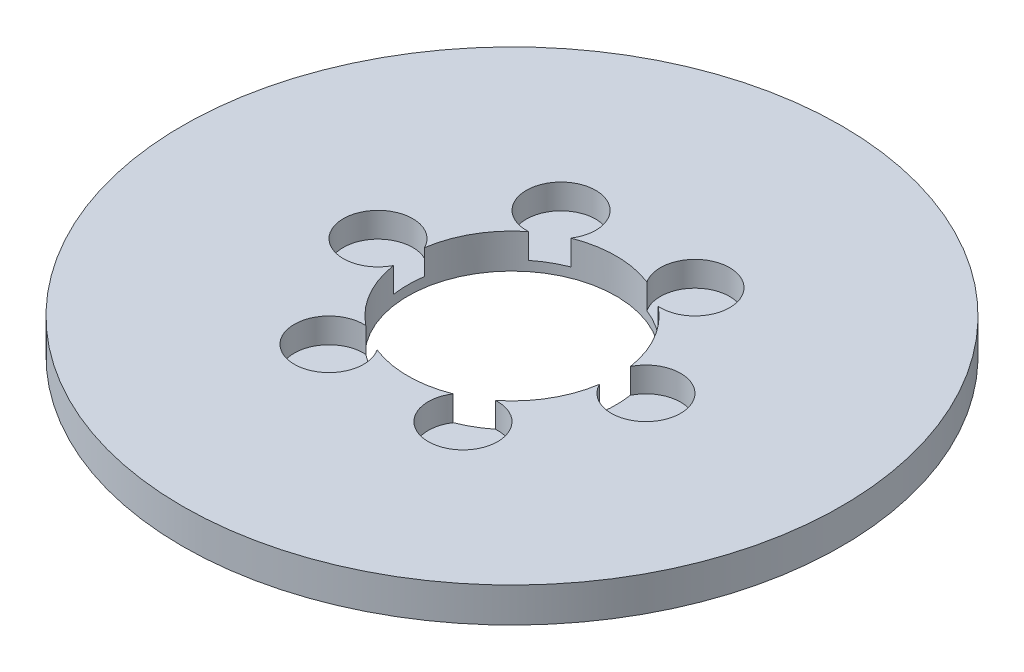
ISO-10303-21;
HEADER;
FILE_DESCRIPTION(('STEP AP214'),'2;1');
FILE_NAME('part.step','',(''),(''),'','','');
FILE_SCHEMA(('AUTOMOTIVE_DESIGN { 1 0 10303 214 1 1 1 1 }'));
ENDSEC;
DATA;
#1=APPLICATION_CONTEXT('core data for automotive mechanical design processes');
#2=APPLICATION_PROTOCOL_DEFINITION('international standard','automotive_design',2000,#1);
#3=PRODUCT_CONTEXT('',#1,'mechanical');
#4=PRODUCT('Part','Part','',(#3));
#5=PRODUCT_RELATED_PRODUCT_CATEGORY('part','',(#4));
#6=PRODUCT_DEFINITION_FORMATION('','',#4);
#7=PRODUCT_DEFINITION_CONTEXT('part definition',#1,'design');
#8=PRODUCT_DEFINITION('design','',#6,#7);
#9=PRODUCT_DEFINITION_SHAPE('','',#8);
#10=(LENGTH_UNIT() NAMED_UNIT(*) SI_UNIT(.MILLI.,.METRE.));
#11=(NAMED_UNIT(*) PLANE_ANGLE_UNIT() SI_UNIT($,.RADIAN.));
#12=(NAMED_UNIT(*) SI_UNIT($,.STERADIAN.) SOLID_ANGLE_UNIT());
#13=UNCERTAINTY_MEASURE_WITH_UNIT(LENGTH_MEASURE(1.E-05),#10,'distance_accuracy_value','');
#14=(GEOMETRIC_REPRESENTATION_CONTEXT(3) GLOBAL_UNCERTAINTY_ASSIGNED_CONTEXT((#13)) GLOBAL_UNIT_ASSIGNED_CONTEXT((#10,
#11,#12)) REPRESENTATION_CONTEXT('',''));
#15=CARTESIAN_POINT('',(0.,0.,0.));
#16=DIRECTION('',(0.,0.,1.));
#17=DIRECTION('',(1.,0.,0.));
#18=AXIS2_PLACEMENT_3D('',#15,#16,#17);
#19=CARTESIAN_POINT('',(0.,10.,0.));
#20=DIRECTION('',(0.,-1.,0.));
#21=DIRECTION('',(0.,0.,-1.));
#22=AXIS2_PLACEMENT_3D('',#19,#20,#21);
#23=CYLINDRICAL_SURFACE('',#22,95.);
#24=CARTESIAN_POINT('',(0.,10.,0.));
#25=DIRECTION('',(0.,1.,0.));
#26=DIRECTION('',(0.,0.,1.));
#27=AXIS2_PLACEMENT_3D('',#24,#25,#26);
#28=CIRCLE('',#27,95.);
#29=CARTESIAN_POINT('',(0.,10.,95.));
#30=VERTEX_POINT('',#29);
#31=EDGE_CURVE('E171',#30,#30,#28,.T.);
#32=ORIENTED_EDGE('',*,*,#31,.F.);
#33=EDGE_LOOP('',(#32));
#34=FACE_BOUND('',#33,.T.);
#35=CARTESIAN_POINT('',(0.,0.,0.));
#36=DIRECTION('',(0.,1.,0.));
#37=DIRECTION('',(0.,0.,1.));
#38=AXIS2_PLACEMENT_3D('',#35,#36,#37);
#39=CIRCLE('',#38,95.);
#40=CARTESIAN_POINT('',(0.,0.,95.));
#41=VERTEX_POINT('',#40);
#42=EDGE_CURVE('E157',#41,#41,#39,.T.);
#43=ORIENTED_EDGE('',*,*,#42,.T.);
#44=EDGE_LOOP('',(#43));
#45=FACE_BOUND('',#44,.T.);
#46=ADVANCED_FACE('F39',(#34,#45),#23,.T.);
#47=CARTESIAN_POINT('',(0.,10.,0.));
#48=DIRECTION('',(0.,1.,0.));
#49=DIRECTION('',(0.,0.,1.));
#50=AXIS2_PLACEMENT_3D('',#47,#48,#49);
#51=PLANE('',#50);
#52=CARTESIAN_POINT('',(-19.3085140114945,10.,-33.4433272865631));
#53=DIRECTION('',(0.,1.,0.));
#54=DIRECTION('',(-0.866025403784433,0.,0.50000000000001));
#55=AXIS2_PLACEMENT_3D('',#52,#53,#54);
#56=CIRCLE('',#55,10.);
#57=CARTESIAN_POINT('',(-10.9709495639196,10.,-27.9220032530965));
#58=VERTEX_POINT('',#57);
#59=CARTESIAN_POINT('',(-18.6956893597741,10.,-23.46212265254));
#60=VERTEX_POINT('',#59);
#61=EDGE_CURVE('E214',#58,#60,#56,.T.);
#62=ORIENTED_EDGE('',*,*,#61,.F.);
#63=CARTESIAN_POINT('',(0.,10.,0.));
#64=DIRECTION('',(0.,1.,0.));
#65=DIRECTION('',(0.,0.,1.));
#66=AXIS2_PLACEMENT_3D('',#63,#64,#65);
#67=CIRCLE('',#66,30.);
#68=CARTESIAN_POINT('',(10.970949563919,10.,-27.9220032530968));
#69=VERTEX_POINT('',#68);
#70=EDGE_CURVE('E272',#69,#58,#67,.T.);
#71=ORIENTED_EDGE('',*,*,#70,.F.);
#72=CARTESIAN_POINT('',(19.3085140114938,10.,-33.4433272865635));
#73=DIRECTION('',(0.,1.,0.));
#74=DIRECTION('',(-0.866025403784443,0.,-0.499999999999992));
#75=AXIS2_PLACEMENT_3D('',#72,#73,#74);
#76=CIRCLE('',#75,10.);
#77=CARTESIAN_POINT('',(18.6956893597736,10.,-23.4621226525404));
#78=VERTEX_POINT('',#77);
#79=EDGE_CURVE('E285',#78,#69,#76,.T.);
#80=ORIENTED_EDGE('',*,*,#79,.F.);
#81=CARTESIAN_POINT('',(29.6666389236931,10.,-4.45988060055644));
#82=VERTEX_POINT('',#81);
#83=EDGE_CURVE('E165',#82,#78,#67,.T.);
#84=ORIENTED_EDGE('',*,*,#83,.F.);
#85=CARTESIAN_POINT('',(38.6170280229882,10.,0.));
#86=DIRECTION('',(0.,1.,0.));
#87=DIRECTION('',(0.,0.,-1.));
#88=AXIS2_PLACEMENT_3D('',#85,#86,#87);
#89=CIRCLE('',#88,10.);
#90=CARTESIAN_POINT('',(29.6666389236931,10.,4.45988060055644));
#91=VERTEX_POINT('',#90);
#92=EDGE_CURVE('E281',#91,#82,#89,.T.);
#93=ORIENTED_EDGE('',*,*,#92,.F.);
#94=CARTESIAN_POINT('',(18.6956893597739,10.,23.4621226525401));
#95=VERTEX_POINT('',#94);
#96=EDGE_CURVE('E160',#95,#91,#67,.T.);
#97=ORIENTED_EDGE('',*,*,#96,.F.);
#98=CARTESIAN_POINT('',(19.3085140114942,10.,33.4433272865632));
#99=DIRECTION('',(0.,1.,0.));
#100=DIRECTION('',(0.866025403784436,0.,-0.500000000000004));
#101=AXIS2_PLACEMENT_3D('',#98,#99,#100);
#102=CIRCLE('',#101,10.);
#103=CARTESIAN_POINT('',(10.9709495639194,10.,27.9220032530966));
#104=VERTEX_POINT('',#103);
#105=EDGE_CURVE('E154',#104,#95,#102,.T.);
#106=ORIENTED_EDGE('',*,*,#105,.F.);
#107=CARTESIAN_POINT('',(-10.9709495639192,10.,27.9220032530967));
#108=VERTEX_POINT('',#107);
#109=EDGE_CURVE('E150',#108,#104,#67,.T.);
#110=ORIENTED_EDGE('',*,*,#109,.F.);
#111=CARTESIAN_POINT('',(-19.308514011494,10.,33.4433272865633));
#112=DIRECTION('',(0.,1.,0.));
#113=DIRECTION('',(0.86602540378444,0.,0.499999999999998));
#114=AXIS2_PLACEMENT_3D('',#111,#112,#113);
#115=CIRCLE('',#114,10.);
#116=CARTESIAN_POINT('',(-18.6956893597738,10.,23.4621226525403));
#117=VERTEX_POINT('',#116);
#118=EDGE_CURVE('E127',#117,#108,#115,.T.);
#119=ORIENTED_EDGE('',*,*,#118,.F.);
#120=CARTESIAN_POINT('',(-29.6666389236931,10.,4.45988060055644));
#121=VERTEX_POINT('',#120);
#122=EDGE_CURVE('E156',#121,#117,#67,.T.);
#123=ORIENTED_EDGE('',*,*,#122,.F.);
#124=CARTESIAN_POINT('',(-38.6170280229882,10.,0.));
#125=DIRECTION('',(0.,1.,0.));
#126=DIRECTION('',(0.,0.,1.));
#127=AXIS2_PLACEMENT_3D('',#124,#125,#126);
#128=CIRCLE('',#127,10.);
#129=CARTESIAN_POINT('',(-29.6666389236931,10.,-4.45988060055644));
#130=VERTEX_POINT('',#129);
#131=EDGE_CURVE('E164',#130,#121,#128,.T.);
#132=ORIENTED_EDGE('',*,*,#131,.F.);
#133=EDGE_CURVE('E159',#60,#130,#67,.T.);
#134=ORIENTED_EDGE('',*,*,#133,.F.);
#135=EDGE_LOOP('',(#62,#71,#80,#84,#93,#97,#106,#110,#119,#123,#132,#134));
#136=FACE_BOUND('',#135,.T.);
#137=ORIENTED_EDGE('',*,*,#31,.T.);
#138=EDGE_LOOP('',(#137));
#139=FACE_BOUND('',#138,.T.);
#140=ADVANCED_FACE('F155',(#136,#139),#51,.T.);
#141=CARTESIAN_POINT('',(0.,0.,0.));
#142=DIRECTION('',(0.,1.,0.));
#143=DIRECTION('',(0.,0.,1.));
#144=AXIS2_PLACEMENT_3D('',#141,#142,#143);
#145=PLANE('',#144);
#146=CARTESIAN_POINT('',(0.,0.,0.));
#147=DIRECTION('',(0.,1.,0.));
#148=DIRECTION('',(0.,0.,1.));
#149=AXIS2_PLACEMENT_3D('',#146,#147,#148);
#150=CIRCLE('',#149,30.);
#151=CARTESIAN_POINT('',(0.,0.,30.));
#152=VERTEX_POINT('',#151);
#153=EDGE_CURVE('E170',#152,#152,#150,.T.);
#154=ORIENTED_EDGE('',*,*,#153,.T.);
#155=EDGE_LOOP('',(#154));
#156=FACE_BOUND('',#155,.T.);
#157=ORIENTED_EDGE('',*,*,#42,.F.);
#158=EDGE_LOOP('',(#157));
#159=FACE_BOUND('',#158,.T.);
#160=ADVANCED_FACE('F232',(#156,#159),#145,.F.);
#161=CARTESIAN_POINT('',(0.,10.,0.));
#162=DIRECTION('',(0.,-1.,0.));
#163=DIRECTION('',(0.,0.,-1.));
#164=AXIS2_PLACEMENT_3D('',#161,#162,#163);
#165=CYLINDRICAL_SURFACE('',#164,30.);
#166=DIRECTION('',(0.,1.,0.));
#167=VECTOR('',#166,1.);
#168=CARTESIAN_POINT('',(-10.9709495639196,6.40217494034691,-27.9220032530965));
#169=LINE('',#168,#167);
#170=CARTESIAN_POINT('',(-10.9709495639196,2.80434988069383,-27.9220032530965));
#171=VERTEX_POINT('',#170);
#172=EDGE_CURVE('E11',#171,#58,#169,.T.);
#173=ORIENTED_EDGE('',*,*,#172,.F.);
#174=CARTESIAN_POINT('',(0.,2.80434988069383,0.));
#175=DIRECTION('',(0.,1.,0.));
#176=DIRECTION('',(0.,0.,1.));
#177=AXIS2_PLACEMENT_3D('',#174,#175,#176);
#178=CIRCLE('',#177,30.);
#179=CARTESIAN_POINT('',(-18.6956893597741,2.80434988069383,-23.46212265254));
#180=VERTEX_POINT('',#179);
#181=EDGE_CURVE('E209',#171,#180,#178,.T.);
#182=ORIENTED_EDGE('',*,*,#181,.T.);
#183=DIRECTION('',(0.,1.,0.));
#184=VECTOR('',#183,1.);
#185=CARTESIAN_POINT('',(-18.6956893597741,6.40217494034691,-23.46212265254));
#186=LINE('',#185,#184);
#187=EDGE_CURVE('E46',#60,#180,#186,.F.);
#188=ORIENTED_EDGE('',*,*,#187,.F.);
#189=ORIENTED_EDGE('',*,*,#133,.T.);
#190=DIRECTION('',(0.,1.,0.));
#191=VECTOR('',#190,1.);
#192=CARTESIAN_POINT('',(-29.6666389236931,6.40217494034691,-4.45988060055644));
#193=LINE('',#192,#191);
#194=CARTESIAN_POINT('',(-29.6666389236931,2.80434988069383,-4.45988060055644));
#195=VERTEX_POINT('',#194);
#196=EDGE_CURVE('E185',#195,#130,#193,.T.);
#197=ORIENTED_EDGE('',*,*,#196,.F.);
#198=CARTESIAN_POINT('',(0.,2.80434988069383,0.));
#199=DIRECTION('',(0.,1.,0.));
#200=DIRECTION('',(0.,0.,1.));
#201=AXIS2_PLACEMENT_3D('',#198,#199,#200);
#202=CIRCLE('',#201,30.);
#203=CARTESIAN_POINT('',(-29.6666389236931,2.80434988069383,4.45988060055644));
#204=VERTEX_POINT('',#203);
#205=EDGE_CURVE('E173',#195,#204,#202,.T.);
#206=ORIENTED_EDGE('',*,*,#205,.T.);
#207=DIRECTION('',(0.,1.,0.));
#208=VECTOR('',#207,1.);
#209=CARTESIAN_POINT('',(-29.6666389236931,6.40217494034691,4.45988060055644));
#210=LINE('',#209,#208);
#211=EDGE_CURVE('E178',#121,#204,#210,.F.);
#212=ORIENTED_EDGE('',*,*,#211,.F.);
#213=ORIENTED_EDGE('',*,*,#122,.T.);
#214=DIRECTION('',(0.,1.,0.));
#215=VECTOR('',#214,1.);
#216=CARTESIAN_POINT('',(-18.6956893597738,6.40217494034691,23.4621226525403));
#217=LINE('',#216,#215);
#218=CARTESIAN_POINT('',(-18.6956893597738,2.80434988069383,23.4621226525403));
#219=VERTEX_POINT('',#218);
#220=EDGE_CURVE('E132',#219,#117,#217,.T.);
#221=ORIENTED_EDGE('',*,*,#220,.F.);
#222=CARTESIAN_POINT('',(0.,2.80434988069383,0.));
#223=DIRECTION('',(0.,1.,0.));
#224=DIRECTION('',(0.,0.,1.));
#225=AXIS2_PLACEMENT_3D('',#222,#223,#224);
#226=CIRCLE('',#225,30.);
#227=CARTESIAN_POINT('',(-10.9709495639192,2.80434988069383,27.9220032530967));
#228=VERTEX_POINT('',#227);
#229=EDGE_CURVE('E146',#219,#228,#226,.T.);
#230=ORIENTED_EDGE('',*,*,#229,.T.);
#231=DIRECTION('',(0.,1.,0.));
#232=VECTOR('',#231,1.);
#233=CARTESIAN_POINT('',(-10.9709495639192,6.40217494034691,27.9220032530967));
#234=LINE('',#233,#232);
#235=EDGE_CURVE('E128',#108,#228,#234,.F.);
#236=ORIENTED_EDGE('',*,*,#235,.F.);
#237=ORIENTED_EDGE('',*,*,#109,.T.);
#238=DIRECTION('',(0.,1.,0.));
#239=VECTOR('',#238,1.);
#240=CARTESIAN_POINT('',(10.9709495639194,6.40217494034691,27.9220032530966));
#241=LINE('',#240,#239);
#242=CARTESIAN_POINT('',(10.9709495639194,2.80434988069383,27.9220032530966));
#243=VERTEX_POINT('',#242);
#244=EDGE_CURVE('E192',#243,#104,#241,.T.);
#245=ORIENTED_EDGE('',*,*,#244,.F.);
#246=CARTESIAN_POINT('',(0.,2.80434988069383,0.));
#247=DIRECTION('',(0.,1.,0.));
#248=DIRECTION('',(0.,0.,1.));
#249=AXIS2_PLACEMENT_3D('',#246,#247,#248);
#250=CIRCLE('',#249,30.);
#251=CARTESIAN_POINT('',(18.6956893597739,2.80434988069383,23.4621226525401));
#252=VERTEX_POINT('',#251);
#253=EDGE_CURVE('E190',#243,#252,#250,.T.);
#254=ORIENTED_EDGE('',*,*,#253,.T.);
#255=DIRECTION('',(0.,1.,0.));
#256=VECTOR('',#255,1.);
#257=CARTESIAN_POINT('',(18.6956893597739,6.40217494034691,23.4621226525401));
#258=LINE('',#257,#256);
#259=EDGE_CURVE('E189',#95,#252,#258,.F.);
#260=ORIENTED_EDGE('',*,*,#259,.F.);
#261=ORIENTED_EDGE('',*,*,#96,.T.);
#262=DIRECTION('',(0.,1.,0.));
#263=VECTOR('',#262,1.);
#264=CARTESIAN_POINT('',(29.6666389236931,6.40217494034691,4.45988060055644));
#265=LINE('',#264,#263);
#266=CARTESIAN_POINT('',(29.6666389236931,2.80434988069383,4.45988060055644));
#267=VERTEX_POINT('',#266);
#268=EDGE_CURVE('E203',#267,#91,#265,.T.);
#269=ORIENTED_EDGE('',*,*,#268,.F.);
#270=CARTESIAN_POINT('',(0.,2.80434988069383,0.));
#271=DIRECTION('',(0.,1.,0.));
#272=DIRECTION('',(0.,0.,1.));
#273=AXIS2_PLACEMENT_3D('',#270,#271,#272);
#274=CIRCLE('',#273,30.);
#275=CARTESIAN_POINT('',(29.6666389236931,2.80434988069383,-4.45988060055644));
#276=VERTEX_POINT('',#275);
#277=EDGE_CURVE('E194',#267,#276,#274,.T.);
#278=ORIENTED_EDGE('',*,*,#277,.T.);
#279=DIRECTION('',(0.,1.,0.));
#280=VECTOR('',#279,1.);
#281=CARTESIAN_POINT('',(29.6666389236931,6.40217494034691,-4.45988060055644));
#282=LINE('',#281,#280);
#283=EDGE_CURVE('E196',#82,#276,#282,.F.);
#284=ORIENTED_EDGE('',*,*,#283,.F.);
#285=ORIENTED_EDGE('',*,*,#83,.T.);
#286=DIRECTION('',(0.,1.,0.));
#287=VECTOR('',#286,1.);
#288=CARTESIAN_POINT('',(18.6956893597736,6.40217494034691,-23.4621226525404));
#289=LINE('',#288,#287);
#290=CARTESIAN_POINT('',(18.6956893597736,2.80434988069383,-23.4621226525404));
#291=VERTEX_POINT('',#290);
#292=EDGE_CURVE('E208',#291,#78,#289,.T.);
#293=ORIENTED_EDGE('',*,*,#292,.F.);
#294=CARTESIAN_POINT('',(0.,2.80434988069383,0.));
#295=DIRECTION('',(0.,1.,0.));
#296=DIRECTION('',(0.,0.,1.));
#297=AXIS2_PLACEMENT_3D('',#294,#295,#296);
#298=CIRCLE('',#297,30.);
#299=CARTESIAN_POINT('',(10.970949563919,2.80434988069383,-27.9220032530968));
#300=VERTEX_POINT('',#299);
#301=EDGE_CURVE('E201',#291,#300,#298,.T.);
#302=ORIENTED_EDGE('',*,*,#301,.T.);
#303=DIRECTION('',(0.,1.,0.));
#304=VECTOR('',#303,1.);
#305=CARTESIAN_POINT('',(10.970949563919,6.40217494034691,-27.9220032530968));
#306=LINE('',#305,#304);
#307=EDGE_CURVE('E206',#69,#300,#306,.F.);
#308=ORIENTED_EDGE('',*,*,#307,.F.);
#309=ORIENTED_EDGE('',*,*,#70,.T.);
#310=EDGE_LOOP('',(#173,#182,#188,#189,#197,#206,#212,#213,#221,#230,#236,#237,#245,#254,#260,
#261,#269,#278,#284,#285,#293,#302,#308,#309));
#311=FACE_BOUND('',#310,.T.);
#312=ORIENTED_EDGE('',*,*,#153,.F.);
#313=EDGE_LOOP('',(#312));
#314=FACE_BOUND('',#313,.T.);
#315=ADVANCED_FACE('F145',(#311,#314),#165,.F.);
#316=CARTESIAN_POINT('',(-38.6170280229882,2.80434988069383,0.));
#317=DIRECTION('',(0.,1.,0.));
#318=DIRECTION('',(0.,0.,1.));
#319=AXIS2_PLACEMENT_3D('',#316,#317,#318);
#320=CYLINDRICAL_SURFACE('',#319,10.);
#321=ORIENTED_EDGE('',*,*,#196,.T.);
#322=ORIENTED_EDGE('',*,*,#131,.T.);
#323=ORIENTED_EDGE('',*,*,#211,.T.);
#324=CARTESIAN_POINT('',(-38.6170280229882,2.80434988069383,0.));
#325=DIRECTION('',(0.,1.,0.));
#326=DIRECTION('',(0.,0.,1.));
#327=AXIS2_PLACEMENT_3D('',#324,#325,#326);
#328=CIRCLE('',#327,10.);
#329=EDGE_CURVE('E168',#195,#204,#328,.T.);
#330=ORIENTED_EDGE('',*,*,#329,.F.);
#331=EDGE_LOOP('',(#321,#322,#323,#330));
#332=FACE_BOUND('',#331,.T.);
#333=ADVANCED_FACE('F243',(#332),#320,.F.);
#334=CARTESIAN_POINT('',(-38.6170280229882,2.80434988069383,0.));
#335=DIRECTION('',(0.,1.,0.));
#336=DIRECTION('',(0.,0.,1.));
#337=AXIS2_PLACEMENT_3D('',#334,#335,#336);
#338=PLANE('',#337);
#339=ORIENTED_EDGE('',*,*,#329,.T.);
#340=ORIENTED_EDGE('',*,*,#205,.F.);
#341=EDGE_LOOP('',(#339,#340));
#342=FACE_BOUND('',#341,.T.);
#343=ADVANCED_FACE('F247',(#342),#338,.T.);
#344=CARTESIAN_POINT('',(-19.308514011494,2.80434988069383,33.4433272865633));
#345=DIRECTION('',(0.,1.,0.));
#346=DIRECTION('',(0.,0.,1.));
#347=AXIS2_PLACEMENT_3D('',#344,#345,#346);
#348=CYLINDRICAL_SURFACE('',#347,10.);
#349=ORIENTED_EDGE('',*,*,#220,.T.);
#350=ORIENTED_EDGE('',*,*,#118,.T.);
#351=ORIENTED_EDGE('',*,*,#235,.T.);
#352=CARTESIAN_POINT('',(-19.308514011494,2.80434988069383,33.4433272865633));
#353=DIRECTION('',(0.,1.,0.));
#354=DIRECTION('',(0.86602540378444,0.,0.499999999999998));
#355=AXIS2_PLACEMENT_3D('',#352,#353,#354);
#356=CIRCLE('',#355,10.);
#357=EDGE_CURVE('E137',#219,#228,#356,.T.);
#358=ORIENTED_EDGE('',*,*,#357,.F.);
#359=EDGE_LOOP('',(#349,#350,#351,#358));
#360=FACE_BOUND('',#359,.T.);
#361=ADVANCED_FACE('F126',(#360),#348,.F.);
#362=CARTESIAN_POINT('',(-19.308514011494,2.80434988069383,33.4433272865633));
#363=DIRECTION('',(0.,1.,0.));
#364=DIRECTION('',(0.86602540378444,0.,0.499999999999998));
#365=AXIS2_PLACEMENT_3D('',#362,#363,#364);
#366=PLANE('',#365);
#367=ORIENTED_EDGE('',*,*,#357,.T.);
#368=ORIENTED_EDGE('',*,*,#229,.F.);
#369=EDGE_LOOP('',(#367,#368));
#370=FACE_BOUND('',#369,.T.);
#371=ADVANCED_FACE('F254',(#370),#366,.T.);
#372=CARTESIAN_POINT('',(19.3085140114942,2.80434988069383,33.4433272865632));
#373=DIRECTION('',(0.,1.,0.));
#374=DIRECTION('',(0.,0.,1.));
#375=AXIS2_PLACEMENT_3D('',#372,#373,#374);
#376=CYLINDRICAL_SURFACE('',#375,10.);
#377=ORIENTED_EDGE('',*,*,#244,.T.);
#378=ORIENTED_EDGE('',*,*,#105,.T.);
#379=ORIENTED_EDGE('',*,*,#259,.T.);
#380=CARTESIAN_POINT('',(19.3085140114942,2.80434988069383,33.4433272865632));
#381=DIRECTION('',(0.,1.,0.));
#382=DIRECTION('',(0.866025403784436,0.,-0.500000000000004));
#383=AXIS2_PLACEMENT_3D('',#380,#381,#382);
#384=CIRCLE('',#383,10.);
#385=EDGE_CURVE('E138',#243,#252,#384,.T.);
#386=ORIENTED_EDGE('',*,*,#385,.F.);
#387=EDGE_LOOP('',(#377,#378,#379,#386));
#388=FACE_BOUND('',#387,.T.);
#389=ADVANCED_FACE('F260',(#388),#376,.F.);
#390=CARTESIAN_POINT('',(19.3085140114942,2.80434988069383,33.4433272865632));
#391=DIRECTION('',(0.,1.,0.));
#392=DIRECTION('',(0.866025403784436,0.,-0.500000000000004));
#393=AXIS2_PLACEMENT_3D('',#390,#391,#392);
#394=PLANE('',#393);
#395=ORIENTED_EDGE('',*,*,#385,.T.);
#396=ORIENTED_EDGE('',*,*,#253,.F.);
#397=EDGE_LOOP('',(#395,#396));
#398=FACE_BOUND('',#397,.T.);
#399=ADVANCED_FACE('F265',(#398),#394,.T.);
#400=CARTESIAN_POINT('',(38.6170280229882,2.80434988069383,0.));
#401=DIRECTION('',(0.,1.,0.));
#402=DIRECTION('',(0.,0.,1.));
#403=AXIS2_PLACEMENT_3D('',#400,#401,#402);
#404=CYLINDRICAL_SURFACE('',#403,10.);
#405=ORIENTED_EDGE('',*,*,#268,.T.);
#406=ORIENTED_EDGE('',*,*,#92,.T.);
#407=ORIENTED_EDGE('',*,*,#283,.T.);
#408=CARTESIAN_POINT('',(38.6170280229882,2.80434988069383,0.));
#409=DIRECTION('',(0.,1.,0.));
#410=DIRECTION('',(0.,0.,-1.));
#411=AXIS2_PLACEMENT_3D('',#408,#409,#410);
#412=CIRCLE('',#411,10.);
#413=EDGE_CURVE('E287',#267,#276,#412,.T.);
#414=ORIENTED_EDGE('',*,*,#413,.F.);
#415=EDGE_LOOP('',(#405,#406,#407,#414));
#416=FACE_BOUND('',#415,.T.);
#417=ADVANCED_FACE('F300',(#416),#404,.F.);
#418=CARTESIAN_POINT('',(38.6170280229882,2.80434988069383,0.));
#419=DIRECTION('',(0.,1.,0.));
#420=DIRECTION('',(0.,0.,-1.));
#421=AXIS2_PLACEMENT_3D('',#418,#419,#420);
#422=PLANE('',#421);
#423=ORIENTED_EDGE('',*,*,#413,.T.);
#424=ORIENTED_EDGE('',*,*,#277,.F.);
#425=EDGE_LOOP('',(#423,#424));
#426=FACE_BOUND('',#425,.T.);
#427=ADVANCED_FACE('F298',(#426),#422,.T.);
#428=CARTESIAN_POINT('',(19.3085140114938,2.80434988069383,-33.4433272865635));
#429=DIRECTION('',(0.,1.,0.));
#430=DIRECTION('',(0.,0.,1.));
#431=AXIS2_PLACEMENT_3D('',#428,#429,#430);
#432=CYLINDRICAL_SURFACE('',#431,10.);
#433=ORIENTED_EDGE('',*,*,#292,.T.);
#434=ORIENTED_EDGE('',*,*,#79,.T.);
#435=ORIENTED_EDGE('',*,*,#307,.T.);
#436=CARTESIAN_POINT('',(19.3085140114938,2.80434988069383,-33.4433272865635));
#437=DIRECTION('',(0.,1.,0.));
#438=DIRECTION('',(-0.866025403784443,0.,-0.499999999999992));
#439=AXIS2_PLACEMENT_3D('',#436,#437,#438);
#440=CIRCLE('',#439,10.);
#441=EDGE_CURVE('E56',#291,#300,#440,.T.);
#442=ORIENTED_EDGE('',*,*,#441,.F.);
#443=EDGE_LOOP('',(#433,#434,#435,#442));
#444=FACE_BOUND('',#443,.T.);
#445=ADVANCED_FACE('F301',(#444),#432,.F.);
#446=CARTESIAN_POINT('',(19.3085140114938,2.80434988069383,-33.4433272865635));
#447=DIRECTION('',(0.,1.,0.));
#448=DIRECTION('',(-0.866025403784443,0.,-0.499999999999992));
#449=AXIS2_PLACEMENT_3D('',#446,#447,#448);
#450=PLANE('',#449);
#451=ORIENTED_EDGE('',*,*,#441,.T.);
#452=ORIENTED_EDGE('',*,*,#301,.F.);
#453=EDGE_LOOP('',(#451,#452));
#454=FACE_BOUND('',#453,.T.);
#455=ADVANCED_FACE('F221',(#454),#450,.T.);
#456=CARTESIAN_POINT('',(-19.3085140114945,2.80434988069383,-33.4433272865631));
#457=DIRECTION('',(0.,1.,0.));
#458=DIRECTION('',(0.,0.,1.));
#459=AXIS2_PLACEMENT_3D('',#456,#457,#458);
#460=CYLINDRICAL_SURFACE('',#459,10.);
#461=ORIENTED_EDGE('',*,*,#172,.T.);
#462=ORIENTED_EDGE('',*,*,#61,.T.);
#463=ORIENTED_EDGE('',*,*,#187,.T.);
#464=CARTESIAN_POINT('',(-19.3085140114945,2.80434988069383,-33.4433272865631));
#465=DIRECTION('',(0.,1.,0.));
#466=DIRECTION('',(-0.866025403784433,0.,0.50000000000001));
#467=AXIS2_PLACEMENT_3D('',#464,#465,#466);
#468=CIRCLE('',#467,10.);
#469=EDGE_CURVE('E55',#171,#180,#468,.T.);
#470=ORIENTED_EDGE('',*,*,#469,.F.);
#471=EDGE_LOOP('',(#461,#462,#463,#470));
#472=FACE_BOUND('',#471,.T.);
#473=ADVANCED_FACE('F212',(#472),#460,.F.);
#474=CARTESIAN_POINT('',(-19.3085140114945,2.80434988069383,-33.4433272865631));
#475=DIRECTION('',(0.,1.,0.));
#476=DIRECTION('',(-0.866025403784433,0.,0.50000000000001));
#477=AXIS2_PLACEMENT_3D('',#474,#475,#476);
#478=PLANE('',#477);
#479=ORIENTED_EDGE('',*,*,#469,.T.);
#480=ORIENTED_EDGE('',*,*,#181,.F.);
#481=EDGE_LOOP('',(#479,#480));
#482=FACE_BOUND('',#481,.T.);
#483=ADVANCED_FACE('F217',(#482),#478,.T.);
#484=CLOSED_SHELL('',(#46,#140,#160,#315,#333,#343,#361,#371,#389,#399,#417,#427,#445,#455,#473,#483));
#485=MANIFOLD_SOLID_BREP('B2',#484);
#486=ADVANCED_BREP_SHAPE_REPRESENTATION('',(#18,#485),#14);
#487=SHAPE_DEFINITION_REPRESENTATION(#9,#486);
ENDSEC;
END-ISO-10303-21;
